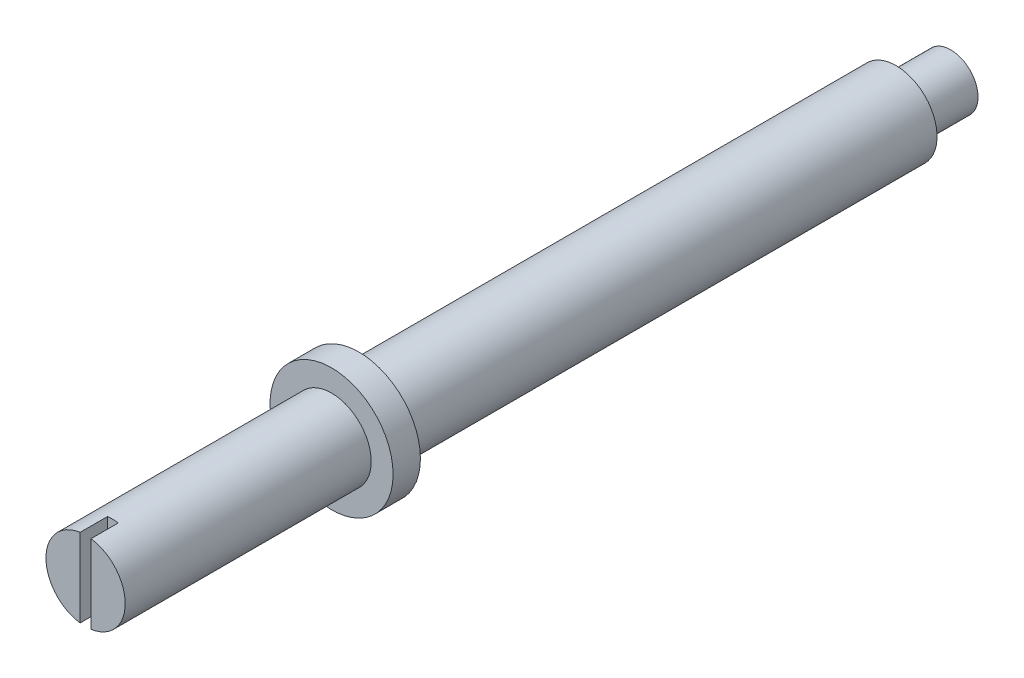
ISO-10303-21;
HEADER;
FILE_DESCRIPTION(('STEP AP214'),'2;1');
FILE_NAME('part.step','',(''),(''),'','','');
FILE_SCHEMA(('AUTOMOTIVE_DESIGN { 1 0 10303 214 1 1 1 1 }'));
ENDSEC;
DATA;
#1=APPLICATION_CONTEXT('core data for automotive mechanical design processes');
#2=APPLICATION_PROTOCOL_DEFINITION('international standard','automotive_design',2000,#1);
#3=PRODUCT_CONTEXT('',#1,'mechanical');
#4=PRODUCT('Part','Part','',(#3));
#5=PRODUCT_RELATED_PRODUCT_CATEGORY('part','',(#4));
#6=PRODUCT_DEFINITION_FORMATION('','',#4);
#7=PRODUCT_DEFINITION_CONTEXT('part definition',#1,'design');
#8=PRODUCT_DEFINITION('design','',#6,#7);
#9=PRODUCT_DEFINITION_SHAPE('','',#8);
#10=(LENGTH_UNIT() NAMED_UNIT(*) SI_UNIT(.MILLI.,.METRE.));
#11=(NAMED_UNIT(*) PLANE_ANGLE_UNIT() SI_UNIT($,.RADIAN.));
#12=(NAMED_UNIT(*) SI_UNIT($,.STERADIAN.) SOLID_ANGLE_UNIT());
#13=UNCERTAINTY_MEASURE_WITH_UNIT(LENGTH_MEASURE(1.E-05),#10,'distance_accuracy_value','');
#14=(GEOMETRIC_REPRESENTATION_CONTEXT(3) GLOBAL_UNCERTAINTY_ASSIGNED_CONTEXT((#13)) GLOBAL_UNIT_ASSIGNED_CONTEXT((#10,
#11,#12)) REPRESENTATION_CONTEXT('',''));
#15=CARTESIAN_POINT('',(0.,0.,0.));
#16=DIRECTION('',(0.,0.,1.));
#17=DIRECTION('',(1.,0.,0.));
#18=AXIS2_PLACEMENT_3D('',#15,#16,#17);
#19=CARTESIAN_POINT('',(0.,0.,22.65));
#20=DIRECTION('',(0.,0.,-1.));
#21=DIRECTION('',(-1.,0.,0.));
#22=AXIS2_PLACEMENT_3D('',#19,#20,#21);
#23=CYLINDRICAL_SURFACE('',#22,1.5);
#24=CARTESIAN_POINT('',(0.,0.,2.));
#25=DIRECTION('',(0.,0.,-1.));
#26=DIRECTION('',(-1.,0.,0.));
#27=AXIS2_PLACEMENT_3D('',#24,#25,#26);
#28=CIRCLE('',#27,1.5);
#29=CARTESIAN_POINT('',(-1.5,0.,2.));
#30=VERTEX_POINT('',#29);
#31=EDGE_CURVE('E133',#30,#30,#28,.T.);
#32=ORIENTED_EDGE('',*,*,#31,.F.);
#33=EDGE_LOOP('',(#32));
#34=FACE_BOUND('',#33,.T.);
#35=CARTESIAN_POINT('',(0.,0.,21.65));
#36=DIRECTION('',(0.,0.,1.));
#37=DIRECTION('',(1.,0.,0.));
#38=AXIS2_PLACEMENT_3D('',#35,#36,#37);
#39=CIRCLE('',#38,1.5);
#40=CARTESIAN_POINT('',(1.5,0.,21.65));
#41=VERTEX_POINT('',#40);
#42=EDGE_CURVE('E11',#41,#41,#39,.T.);
#43=ORIENTED_EDGE('',*,*,#42,.F.);
#44=EDGE_LOOP('',(#43));
#45=FACE_BOUND('',#44,.T.);
#46=ADVANCED_FACE('F39',(#34,#45),#23,.T.);
#47=CARTESIAN_POINT('',(0.,0.,2.));
#48=DIRECTION('',(0.,0.,-1.));
#49=DIRECTION('',(-1.,0.,0.));
#50=AXIS2_PLACEMENT_3D('',#47,#48,#49);
#51=PLANE('',#50);
#52=CARTESIAN_POINT('',(0.,0.,2.));
#53=DIRECTION('',(0.,0.,-1.));
#54=DIRECTION('',(-1.,0.,0.));
#55=AXIS2_PLACEMENT_3D('',#52,#53,#54);
#56=CIRCLE('',#55,1.);
#57=CARTESIAN_POINT('',(-1.,0.,2.));
#58=VERTEX_POINT('',#57);
#59=EDGE_CURVE('E137',#58,#58,#56,.T.);
#60=ORIENTED_EDGE('',*,*,#59,.F.);
#61=EDGE_LOOP('',(#60));
#62=FACE_BOUND('',#61,.T.);
#63=ORIENTED_EDGE('',*,*,#31,.T.);
#64=EDGE_LOOP('',(#63));
#65=FACE_BOUND('',#64,.T.);
#66=ADVANCED_FACE('F165',(#62,#65),#51,.T.);
#67=CARTESIAN_POINT('',(0.,0.,2.));
#68=DIRECTION('',(0.,0.,-1.));
#69=DIRECTION('',(-1.,0.,0.));
#70=AXIS2_PLACEMENT_3D('',#67,#68,#69);
#71=CYLINDRICAL_SURFACE('',#70,1.);
#72=ORIENTED_EDGE('',*,*,#59,.T.);
#73=EDGE_LOOP('',(#72));
#74=FACE_BOUND('',#73,.T.);
#75=CARTESIAN_POINT('',(0.,0.,0.));
#76=DIRECTION('',(0.,0.,-1.));
#77=DIRECTION('',(-1.,0.,0.));
#78=AXIS2_PLACEMENT_3D('',#75,#76,#77);
#79=CIRCLE('',#78,1.);
#80=CARTESIAN_POINT('',(-1.,0.,0.));
#81=VERTEX_POINT('',#80);
#82=EDGE_CURVE('E138',#81,#81,#79,.T.);
#83=ORIENTED_EDGE('',*,*,#82,.F.);
#84=EDGE_LOOP('',(#83));
#85=FACE_BOUND('',#84,.T.);
#86=ADVANCED_FACE('F170',(#74,#85),#71,.T.);
#87=CARTESIAN_POINT('',(0.,0.,0.));
#88=DIRECTION('',(0.,0.,1.));
#89=DIRECTION('',(1.,0.,0.));
#90=AXIS2_PLACEMENT_3D('',#87,#88,#89);
#91=PLANE('',#90);
#92=ORIENTED_EDGE('',*,*,#82,.T.);
#93=EDGE_LOOP('',(#92));
#94=FACE_BOUND('',#93,.T.);
#95=ADVANCED_FACE('F160',(#94),#91,.F.);
#96=CARTESIAN_POINT('',(0.,0.,21.65));
#97=DIRECTION('',(0.,0.,1.));
#98=DIRECTION('',(1.,0.,0.));
#99=AXIS2_PLACEMENT_3D('',#96,#97,#98);
#100=PLANE('',#99);
#101=CARTESIAN_POINT('',(0.,0.,21.65));
#102=DIRECTION('',(0.,0.,1.));
#103=DIRECTION('',(1.,0.,0.));
#104=AXIS2_PLACEMENT_3D('',#101,#102,#103);
#105=CIRCLE('',#104,2.25);
#106=CARTESIAN_POINT('',(2.25,0.,21.65));
#107=VERTEX_POINT('',#106);
#108=EDGE_CURVE('E142',#107,#107,#105,.T.);
#109=ORIENTED_EDGE('',*,*,#108,.F.);
#110=EDGE_LOOP('',(#109));
#111=FACE_BOUND('',#110,.T.);
#112=ORIENTED_EDGE('',*,*,#42,.T.);
#113=EDGE_LOOP('',(#112));
#114=FACE_BOUND('',#113,.T.);
#115=ADVANCED_FACE('F157',(#111,#114),#100,.F.);
#116=CARTESIAN_POINT('',(0.,0.,21.65));
#117=DIRECTION('',(0.,0.,1.));
#118=DIRECTION('',(1.,0.,0.));
#119=AXIS2_PLACEMENT_3D('',#116,#117,#118);
#120=CYLINDRICAL_SURFACE('',#119,2.25);
#121=ORIENTED_EDGE('',*,*,#108,.T.);
#122=EDGE_LOOP('',(#121));
#123=FACE_BOUND('',#122,.T.);
#124=CARTESIAN_POINT('',(0.,0.,22.65));
#125=DIRECTION('',(0.,0.,1.));
#126=DIRECTION('',(1.,0.,0.));
#127=AXIS2_PLACEMENT_3D('',#124,#125,#126);
#128=CIRCLE('',#127,2.25);
#129=CARTESIAN_POINT('',(2.25,0.,22.65));
#130=VERTEX_POINT('',#129);
#131=EDGE_CURVE('E146',#130,#130,#128,.T.);
#132=ORIENTED_EDGE('',*,*,#131,.F.);
#133=EDGE_LOOP('',(#132));
#134=FACE_BOUND('',#133,.T.);
#135=ADVANCED_FACE('F154',(#123,#134),#120,.T.);
#136=CARTESIAN_POINT('',(0.,0.,31.65));
#137=DIRECTION('',(0.,0.,1.));
#138=DIRECTION('',(1.,0.,0.));
#139=AXIS2_PLACEMENT_3D('',#136,#137,#138);
#140=PLANE('',#139);
#141=DIRECTION('',(0.,1.,0.));
#142=VECTOR('',#141,1.);
#143=CARTESIAN_POINT('',(0.2,0.,31.65));
#144=LINE('',#143,#142);
#145=CARTESIAN_POINT('',(0.2,-1.43614066163451,31.65));
#146=VERTEX_POINT('',#145);
#147=CARTESIAN_POINT('',(0.2,1.43614066163451,31.65));
#148=VERTEX_POINT('',#147);
#149=EDGE_CURVE('E79',#146,#148,#144,.T.);
#150=ORIENTED_EDGE('',*,*,#149,.F.);
#151=CARTESIAN_POINT('',(0.,0.,31.65));
#152=DIRECTION('',(0.,0.,1.));
#153=DIRECTION('',(1.,0.,0.));
#154=AXIS2_PLACEMENT_3D('',#151,#152,#153);
#155=CIRCLE('',#154,1.45);
#156=EDGE_CURVE('E96',#146,#148,#155,.T.);
#157=ORIENTED_EDGE('',*,*,#156,.T.);
#158=EDGE_LOOP('',(#150,#157));
#159=FACE_BOUND('',#158,.T.);
#160=ADVANCED_FACE('F101',(#159),#140,.T.);
#161=CARTESIAN_POINT('',(0.2,1.48660687473185,30.65));
#162=DIRECTION('',(1.,0.,0.));
#163=DIRECTION('',(0.,0.,-1.));
#164=AXIS2_PLACEMENT_3D('',#161,#162,#163);
#165=PLANE('',#164);
#166=ORIENTED_EDGE('',*,*,#149,.T.);
#167=DIRECTION('',(0.,0.,-1.));
#168=VECTOR('',#167,1.);
#169=CARTESIAN_POINT('',(0.2,1.43614066163451,31.65));
#170=LINE('',#169,#168);
#171=CARTESIAN_POINT('',(0.2,1.43614066163451,30.65));
#172=VERTEX_POINT('',#171);
#173=EDGE_CURVE('E82',#172,#148,#170,.F.);
#174=ORIENTED_EDGE('',*,*,#173,.F.);
#175=DIRECTION('',(0.,1.,0.));
#176=VECTOR('',#175,1.);
#177=CARTESIAN_POINT('',(0.2,1.48660687473185,30.65));
#178=LINE('',#177,#176);
#179=CARTESIAN_POINT('',(0.2,-1.43614066163451,30.65));
#180=VERTEX_POINT('',#179);
#181=EDGE_CURVE('E121',#180,#172,#178,.T.);
#182=ORIENTED_EDGE('',*,*,#181,.F.);
#183=DIRECTION('',(0.,0.,-1.));
#184=VECTOR('',#183,1.);
#185=CARTESIAN_POINT('',(0.2,-1.43614066163451,31.65));
#186=LINE('',#185,#184);
#187=EDGE_CURVE('E54',#146,#180,#186,.T.);
#188=ORIENTED_EDGE('',*,*,#187,.F.);
#189=EDGE_LOOP('',(#166,#174,#182,#188));
#190=FACE_BOUND('',#189,.T.);
#191=ADVANCED_FACE('F81',(#190),#165,.F.);
#192=CARTESIAN_POINT('',(0.,0.,30.65));
#193=DIRECTION('',(0.,0.,1.));
#194=DIRECTION('',(1.,0.,0.));
#195=AXIS2_PLACEMENT_3D('',#192,#193,#194);
#196=PLANE('',#195);
#197=CARTESIAN_POINT('',(0.,0.,30.65));
#198=DIRECTION('',(0.,0.,1.));
#199=DIRECTION('',(1.,0.,0.));
#200=AXIS2_PLACEMENT_3D('',#197,#198,#199);
#201=CIRCLE('',#200,1.45);
#202=CARTESIAN_POINT('',(-0.2,1.43614066163451,30.65));
#203=VERTEX_POINT('',#202);
#204=EDGE_CURVE('E47',#172,#203,#201,.T.);
#205=ORIENTED_EDGE('',*,*,#204,.T.);
#206=DIRECTION('',(0.,-1.,0.));
#207=VECTOR('',#206,1.);
#208=CARTESIAN_POINT('',(-0.2,-1.48660687473185,30.65));
#209=LINE('',#208,#207);
#210=CARTESIAN_POINT('',(-0.2,-1.43614066163451,30.65));
#211=VERTEX_POINT('',#210);
#212=EDGE_CURVE('E99',#203,#211,#209,.T.);
#213=ORIENTED_EDGE('',*,*,#212,.T.);
#214=EDGE_CURVE('E115',#211,#180,#201,.T.);
#215=ORIENTED_EDGE('',*,*,#214,.T.);
#216=ORIENTED_EDGE('',*,*,#181,.T.);
#217=EDGE_LOOP('',(#205,#213,#215,#216));
#218=FACE_BOUND('',#217,.T.);
#219=ADVANCED_FACE('F120',(#218),#196,.T.);
#220=CARTESIAN_POINT('',(-0.2,-1.48660687473185,30.65));
#221=DIRECTION('',(-1.,0.,0.));
#222=DIRECTION('',(0.,0.,1.));
#223=AXIS2_PLACEMENT_3D('',#220,#221,#222);
#224=PLANE('',#223);
#225=DIRECTION('',(0.,-1.,0.));
#226=VECTOR('',#225,1.);
#227=CARTESIAN_POINT('',(-0.2,0.,31.65));
#228=LINE('',#227,#226);
#229=CARTESIAN_POINT('',(-0.2,1.43614066163451,31.65));
#230=VERTEX_POINT('',#229);
#231=CARTESIAN_POINT('',(-0.2,-1.43614066163451,31.65));
#232=VERTEX_POINT('',#231);
#233=EDGE_CURVE('E88',#230,#232,#228,.T.);
#234=ORIENTED_EDGE('',*,*,#233,.T.);
#235=DIRECTION('',(0.,0.,-1.));
#236=VECTOR('',#235,1.);
#237=CARTESIAN_POINT('',(-0.2,-1.43614066163451,31.65));
#238=LINE('',#237,#236);
#239=EDGE_CURVE('E62',#211,#232,#238,.F.);
#240=ORIENTED_EDGE('',*,*,#239,.F.);
#241=ORIENTED_EDGE('',*,*,#212,.F.);
#242=DIRECTION('',(0.,0.,-1.));
#243=VECTOR('',#242,1.);
#244=CARTESIAN_POINT('',(-0.2,1.43614066163451,31.65));
#245=LINE('',#244,#243);
#246=EDGE_CURVE('E109',#230,#203,#245,.T.);
#247=ORIENTED_EDGE('',*,*,#246,.F.);
#248=EDGE_LOOP('',(#234,#240,#241,#247));
#249=FACE_BOUND('',#248,.T.);
#250=ADVANCED_FACE('F122',(#249),#224,.F.);
#251=ORIENTED_EDGE('',*,*,#233,.F.);
#252=EDGE_CURVE('E89',#230,#232,#155,.T.);
#253=ORIENTED_EDGE('',*,*,#252,.T.);
#254=EDGE_LOOP('',(#251,#253));
#255=FACE_BOUND('',#254,.T.);
#256=ADVANCED_FACE('F187',(#255),#140,.T.);
#257=CARTESIAN_POINT('',(0.,0.,31.65));
#258=DIRECTION('',(0.,0.,-1.));
#259=DIRECTION('',(-1.,0.,0.));
#260=AXIS2_PLACEMENT_3D('',#257,#258,#259);
#261=CYLINDRICAL_SURFACE('',#260,1.45);
#262=ORIENTED_EDGE('',*,*,#252,.F.);
#263=ORIENTED_EDGE('',*,*,#246,.T.);
#264=ORIENTED_EDGE('',*,*,#204,.F.);
#265=ORIENTED_EDGE('',*,*,#173,.T.);
#266=ORIENTED_EDGE('',*,*,#156,.F.);
#267=ORIENTED_EDGE('',*,*,#187,.T.);
#268=ORIENTED_EDGE('',*,*,#214,.F.);
#269=ORIENTED_EDGE('',*,*,#239,.T.);
#270=EDGE_LOOP('',(#262,#263,#264,#265,#266,#267,#268,#269));
#271=FACE_BOUND('',#270,.T.);
#272=CARTESIAN_POINT('',(0.,0.,22.65));
#273=DIRECTION('',(0.,0.,1.));
#274=DIRECTION('',(1.,0.,0.));
#275=AXIS2_PLACEMENT_3D('',#272,#273,#274);
#276=CIRCLE('',#275,1.45);
#277=CARTESIAN_POINT('',(1.45,0.,22.65));
#278=VERTEX_POINT('',#277);
#279=EDGE_CURVE('E103',#278,#278,#276,.T.);
#280=ORIENTED_EDGE('',*,*,#279,.T.);
#281=EDGE_LOOP('',(#280));
#282=FACE_BOUND('',#281,.T.);
#283=ADVANCED_FACE('F94',(#271,#282),#261,.T.);
#284=CARTESIAN_POINT('',(0.,0.,22.65));
#285=DIRECTION('',(0.,0.,1.));
#286=DIRECTION('',(1.,0.,0.));
#287=AXIS2_PLACEMENT_3D('',#284,#285,#286);
#288=PLANE('',#287);
#289=ORIENTED_EDGE('',*,*,#279,.F.);
#290=EDGE_LOOP('',(#289));
#291=FACE_BOUND('',#290,.T.);
#292=ORIENTED_EDGE('',*,*,#131,.T.);
#293=EDGE_LOOP('',(#292));
#294=FACE_BOUND('',#293,.T.);
#295=ADVANCED_FACE('F194',(#291,#294),#288,.T.);
#296=CLOSED_SHELL('',(#46,#66,#86,#95,#115,#135,#160,#191,#219,#250,#256,#283,#295));
#297=MANIFOLD_SOLID_BREP('B2',#296);
#298=ADVANCED_BREP_SHAPE_REPRESENTATION('',(#18,#297),#14);
#299=SHAPE_DEFINITION_REPRESENTATION(#9,#298);
ENDSEC;
END-ISO-10303-21;
